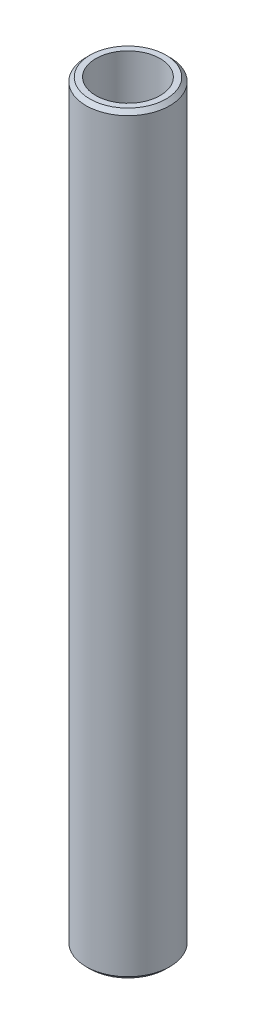
ISO-10303-21;
HEADER;
FILE_DESCRIPTION(('STEP AP214'),'2;1');
FILE_NAME('part.step','',(''),(''),'','','');
FILE_SCHEMA(('AUTOMOTIVE_DESIGN { 1 0 10303 214 1 1 1 1 }'));
ENDSEC;
DATA;
#1=APPLICATION_CONTEXT('core data for automotive mechanical design processes');
#2=APPLICATION_PROTOCOL_DEFINITION('international standard','automotive_design',2000,#1);
#3=PRODUCT_CONTEXT('',#1,'mechanical');
#4=PRODUCT('Part','Part','',(#3));
#5=PRODUCT_RELATED_PRODUCT_CATEGORY('part','',(#4));
#6=PRODUCT_DEFINITION_FORMATION('','',#4);
#7=PRODUCT_DEFINITION_CONTEXT('part definition',#1,'design');
#8=PRODUCT_DEFINITION('design','',#6,#7);
#9=PRODUCT_DEFINITION_SHAPE('','',#8);
#10=(LENGTH_UNIT() NAMED_UNIT(*) SI_UNIT(.MILLI.,.METRE.));
#11=(NAMED_UNIT(*) PLANE_ANGLE_UNIT() SI_UNIT($,.RADIAN.));
#12=(NAMED_UNIT(*) SI_UNIT($,.STERADIAN.) SOLID_ANGLE_UNIT());
#13=UNCERTAINTY_MEASURE_WITH_UNIT(LENGTH_MEASURE(1.E-05),#10,'distance_accuracy_value','');
#14=(GEOMETRIC_REPRESENTATION_CONTEXT(3) GLOBAL_UNCERTAINTY_ASSIGNED_CONTEXT((#13)) GLOBAL_UNIT_ASSIGNED_CONTEXT((#10,
#11,#12)) REPRESENTATION_CONTEXT('',''));
#15=CARTESIAN_POINT('',(0.,0.,0.));
#16=DIRECTION('',(0.,0.,1.));
#17=DIRECTION('',(1.,0.,0.));
#18=AXIS2_PLACEMENT_3D('',#15,#16,#17);
#19=CARTESIAN_POINT('',(0.,539.611379546068,0.));
#20=DIRECTION('',(0.,-1.,0.));
#21=DIRECTION('',(0.,0.,-1.));
#22=AXIS2_PLACEMENT_3D('',#19,#20,#21);
#23=CYLINDRICAL_SURFACE('',#22,30.);
#24=CARTESIAN_POINT('',(0.,536.857603529398,0.));
#25=DIRECTION('',(0.,1.,0.));
#26=DIRECTION('',(0.,0.,1.));
#27=AXIS2_PLACEMENT_3D('',#24,#25,#26);
#28=CIRCLE('',#27,30.);
#29=CARTESIAN_POINT('',(0.,536.857603529398,30.));
#30=VERTEX_POINT('',#29);
#31=EDGE_CURVE('E50',#30,#30,#28,.F.);
#32=ORIENTED_EDGE('',*,*,#31,.T.);
#33=EDGE_LOOP('',(#32));
#34=FACE_BOUND('',#33,.T.);
#35=CARTESIAN_POINT('',(0.,2.75377601666993,0.));
#36=DIRECTION('',(0.,1.,0.));
#37=DIRECTION('',(0.,0.,1.));
#38=AXIS2_PLACEMENT_3D('',#35,#36,#37);
#39=CIRCLE('',#38,30.);
#40=CARTESIAN_POINT('',(0.,2.75377601666993,30.));
#41=VERTEX_POINT('',#40);
#42=EDGE_CURVE('E51',#41,#41,#39,.T.);
#43=ORIENTED_EDGE('',*,*,#42,.T.);
#44=EDGE_LOOP('',(#43));
#45=FACE_BOUND('',#44,.T.);
#46=ADVANCED_FACE('F39',(#34,#45),#23,.T.);
#47=CARTESIAN_POINT('',(0.,539.611379546068,0.));
#48=DIRECTION('',(0.,1.,0.));
#49=DIRECTION('',(0.,0.,1.));
#50=AXIS2_PLACEMENT_3D('',#47,#48,#49);
#51=PLANE('',#50);
#52=CARTESIAN_POINT('',(0.,539.611379546068,0.));
#53=DIRECTION('',(0.,1.,0.));
#54=DIRECTION('',(0.,0.,1.));
#55=AXIS2_PLACEMENT_3D('',#52,#53,#54);
#56=CIRCLE('',#55,27.24622398333);
#57=CARTESIAN_POINT('',(0.,539.611379546068,27.24622398333));
#58=VERTEX_POINT('',#57);
#59=EDGE_CURVE('E54',#58,#58,#56,.T.);
#60=ORIENTED_EDGE('',*,*,#59,.T.);
#61=EDGE_LOOP('',(#60));
#62=FACE_BOUND('',#61,.T.);
#63=CARTESIAN_POINT('',(0.,539.611379546068,0.));
#64=DIRECTION('',(0.,1.,0.));
#65=DIRECTION('',(0.,0.,1.));
#66=AXIS2_PLACEMENT_3D('',#63,#64,#65);
#67=CIRCLE('',#66,23.0109652644852);
#68=CARTESIAN_POINT('',(0.,539.611379546068,23.0109652644852));
#69=VERTEX_POINT('',#68);
#70=EDGE_CURVE('E58',#69,#69,#67,.T.);
#71=ORIENTED_EDGE('',*,*,#70,.F.);
#72=EDGE_LOOP('',(#71));
#73=FACE_BOUND('',#72,.T.);
#74=ADVANCED_FACE('F69',(#62,#73),#51,.T.);
#75=CARTESIAN_POINT('',(0.,0.,0.));
#76=DIRECTION('',(0.,1.,0.));
#77=DIRECTION('',(0.,0.,1.));
#78=AXIS2_PLACEMENT_3D('',#75,#76,#77);
#79=PLANE('',#78);
#80=CARTESIAN_POINT('',(0.,0.,0.));
#81=DIRECTION('',(0.,1.,0.));
#82=DIRECTION('',(0.,0.,1.));
#83=AXIS2_PLACEMENT_3D('',#80,#81,#82);
#84=CIRCLE('',#83,27.24622398333);
#85=CARTESIAN_POINT('',(0.,0.,27.24622398333));
#86=VERTEX_POINT('',#85);
#87=EDGE_CURVE('E10',#86,#86,#84,.F.);
#88=ORIENTED_EDGE('',*,*,#87,.T.);
#89=EDGE_LOOP('',(#88));
#90=FACE_BOUND('',#89,.T.);
#91=CARTESIAN_POINT('',(0.,0.,0.));
#92=DIRECTION('',(0.,1.,0.));
#93=DIRECTION('',(0.,0.,1.));
#94=AXIS2_PLACEMENT_3D('',#91,#92,#93);
#95=CIRCLE('',#94,23.0109652644852);
#96=CARTESIAN_POINT('',(0.,0.,23.0109652644852));
#97=VERTEX_POINT('',#96);
#98=EDGE_CURVE('E63',#97,#97,#95,.T.);
#99=ORIENTED_EDGE('',*,*,#98,.T.);
#100=EDGE_LOOP('',(#99));
#101=FACE_BOUND('',#100,.T.);
#102=ADVANCED_FACE('F75',(#90,#101),#79,.F.);
#103=CARTESIAN_POINT('',(0.,539.611379546068,0.));
#104=DIRECTION('',(0.,-1.,0.));
#105=DIRECTION('',(0.,0.,-1.));
#106=AXIS2_PLACEMENT_3D('',#103,#104,#105);
#107=CYLINDRICAL_SURFACE('',#106,23.0109652644852);
#108=ORIENTED_EDGE('',*,*,#70,.T.);
#109=EDGE_LOOP('',(#108));
#110=FACE_BOUND('',#109,.T.);
#111=ORIENTED_EDGE('',*,*,#98,.F.);
#112=EDGE_LOOP('',(#111));
#113=FACE_BOUND('',#112,.T.);
#114=ADVANCED_FACE('F70',(#110,#113),#107,.F.);
#115=CARTESIAN_POINT('',(0.,539.611379546068,0.));
#116=DIRECTION('',(0.,-1.,0.));
#117=DIRECTION('',(0.,0.,-1.));
#118=AXIS2_PLACEMENT_3D('',#115,#116,#117);
#119=CONICAL_SURFACE('',#118,27.24622398333,0.785398163397463);
#120=ORIENTED_EDGE('',*,*,#31,.F.);
#121=EDGE_LOOP('',(#120));
#122=FACE_BOUND('',#121,.T.);
#123=ORIENTED_EDGE('',*,*,#59,.F.);
#124=EDGE_LOOP('',(#123));
#125=FACE_BOUND('',#124,.T.);
#126=ADVANCED_FACE('F81',(#122,#125),#119,.T.);
#127=CARTESIAN_POINT('',(0.,2.75377601666993,0.));
#128=DIRECTION('',(0.,1.,0.));
#129=DIRECTION('',(0.,0.,1.));
#130=AXIS2_PLACEMENT_3D('',#127,#128,#129);
#131=CONICAL_SURFACE('',#130,30.,0.785398163397453);
#132=ORIENTED_EDGE('',*,*,#87,.F.);
#133=EDGE_LOOP('',(#132));
#134=FACE_BOUND('',#133,.T.);
#135=ORIENTED_EDGE('',*,*,#42,.F.);
#136=EDGE_LOOP('',(#135));
#137=FACE_BOUND('',#136,.T.);
#138=ADVANCED_FACE('F45',(#134,#137),#131,.T.);
#139=CLOSED_SHELL('',(#46,#74,#102,#114,#126,#138));
#140=MANIFOLD_SOLID_BREP('B2',#139);
#141=ADVANCED_BREP_SHAPE_REPRESENTATION('',(#18,#140),#14);
#142=SHAPE_DEFINITION_REPRESENTATION(#9,#141);
ENDSEC;
END-ISO-10303-21;
